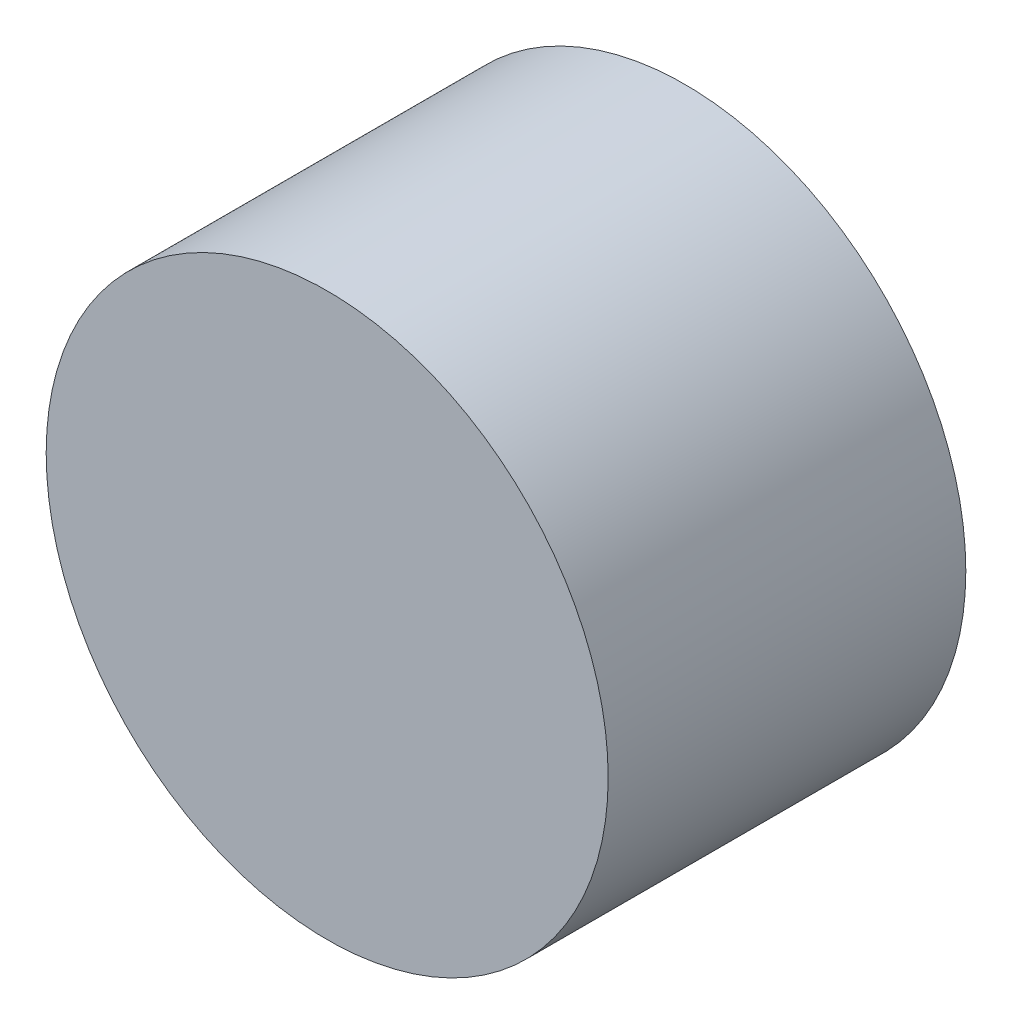
ISO-10303-21;
HEADER;
FILE_DESCRIPTION(('STEP AP214'),'2;1');
FILE_NAME('part.step','',(''),(''),'','','');
FILE_SCHEMA(('AUTOMOTIVE_DESIGN { 1 0 10303 214 1 1 1 1 }'));
ENDSEC;
DATA;
#1=APPLICATION_CONTEXT('core data for automotive mechanical design processes');
#2=APPLICATION_PROTOCOL_DEFINITION('international standard','automotive_design',2000,#1);
#3=PRODUCT_CONTEXT('',#1,'mechanical');
#4=PRODUCT('Part','Part','',(#3));
#5=PRODUCT_RELATED_PRODUCT_CATEGORY('part','',(#4));
#6=PRODUCT_DEFINITION_FORMATION('','',#4);
#7=PRODUCT_DEFINITION_CONTEXT('part definition',#1,'design');
#8=PRODUCT_DEFINITION('design','',#6,#7);
#9=PRODUCT_DEFINITION_SHAPE('','',#8);
#10=(LENGTH_UNIT() NAMED_UNIT(*) SI_UNIT(.MILLI.,.METRE.));
#11=(NAMED_UNIT(*) PLANE_ANGLE_UNIT() SI_UNIT($,.RADIAN.));
#12=(NAMED_UNIT(*) SI_UNIT($,.STERADIAN.) SOLID_ANGLE_UNIT());
#13=UNCERTAINTY_MEASURE_WITH_UNIT(LENGTH_MEASURE(1.E-05),#10,'distance_accuracy_value','');
#14=(GEOMETRIC_REPRESENTATION_CONTEXT(3) GLOBAL_UNCERTAINTY_ASSIGNED_CONTEXT((#13)) GLOBAL_UNIT_ASSIGNED_CONTEXT((#10,
#11,#12)) REPRESENTATION_CONTEXT('',''));
#15=CARTESIAN_POINT('',(0.,0.,0.));
#16=DIRECTION('',(0.,0.,1.));
#17=DIRECTION('',(1.,0.,0.));
#18=AXIS2_PLACEMENT_3D('',#15,#16,#17);
#19=CARTESIAN_POINT('',(0.,0.,0.889));
#20=DIRECTION('',(0.,0.,-1.));
#21=DIRECTION('',(-1.,0.,0.));
#22=AXIS2_PLACEMENT_3D('',#19,#20,#21);
#23=CYLINDRICAL_SURFACE('',#22,1.397);
#24=CARTESIAN_POINT('',(0.,0.,0.889));
#25=DIRECTION('',(0.,0.,1.));
#26=DIRECTION('',(1.,0.,0.));
#27=AXIS2_PLACEMENT_3D('',#24,#25,#26);
#28=CIRCLE('',#27,1.397);
#29=CARTESIAN_POINT('',(1.397,0.,0.889));
#30=VERTEX_POINT('',#29);
#31=EDGE_CURVE('E10',#30,#30,#28,.T.);
#32=ORIENTED_EDGE('',*,*,#31,.F.);
#33=EDGE_LOOP('',(#32));
#34=FACE_BOUND('',#33,.T.);
#35=CARTESIAN_POINT('',(0.,0.,-0.889));
#36=DIRECTION('',(0.,0.,1.));
#37=DIRECTION('',(1.,0.,0.));
#38=AXIS2_PLACEMENT_3D('',#35,#36,#37);
#39=CIRCLE('',#38,1.397);
#40=CARTESIAN_POINT('',(1.397,0.,-0.889));
#41=VERTEX_POINT('',#40);
#42=EDGE_CURVE('E38',#41,#41,#39,.T.);
#43=ORIENTED_EDGE('',*,*,#42,.T.);
#44=EDGE_LOOP('',(#43));
#45=FACE_BOUND('',#44,.T.);
#46=ADVANCED_FACE('F35',(#34,#45),#23,.T.);
#47=CARTESIAN_POINT('',(0.,0.,0.889));
#48=DIRECTION('',(0.,0.,1.));
#49=DIRECTION('',(1.,0.,0.));
#50=AXIS2_PLACEMENT_3D('',#47,#48,#49);
#51=PLANE('',#50);
#52=ORIENTED_EDGE('',*,*,#31,.T.);
#53=EDGE_LOOP('',(#52));
#54=FACE_BOUND('',#53,.T.);
#55=ADVANCED_FACE('F50',(#54),#51,.T.);
#56=CARTESIAN_POINT('',(0.,0.,-0.889));
#57=DIRECTION('',(0.,0.,1.));
#58=DIRECTION('',(1.,0.,0.));
#59=AXIS2_PLACEMENT_3D('',#56,#57,#58);
#60=PLANE('',#59);
#61=ORIENTED_EDGE('',*,*,#42,.F.);
#62=EDGE_LOOP('',(#61));
#63=FACE_BOUND('',#62,.T.);
#64=ADVANCED_FACE('F48',(#63),#60,.F.);
#65=CLOSED_SHELL('',(#46,#55,#64));
#66=MANIFOLD_SOLID_BREP('B2',#65);
#67=ADVANCED_BREP_SHAPE_REPRESENTATION('',(#18,#66),#14);
#68=SHAPE_DEFINITION_REPRESENTATION(#9,#67);
ENDSEC;
END-ISO-10303-21;
